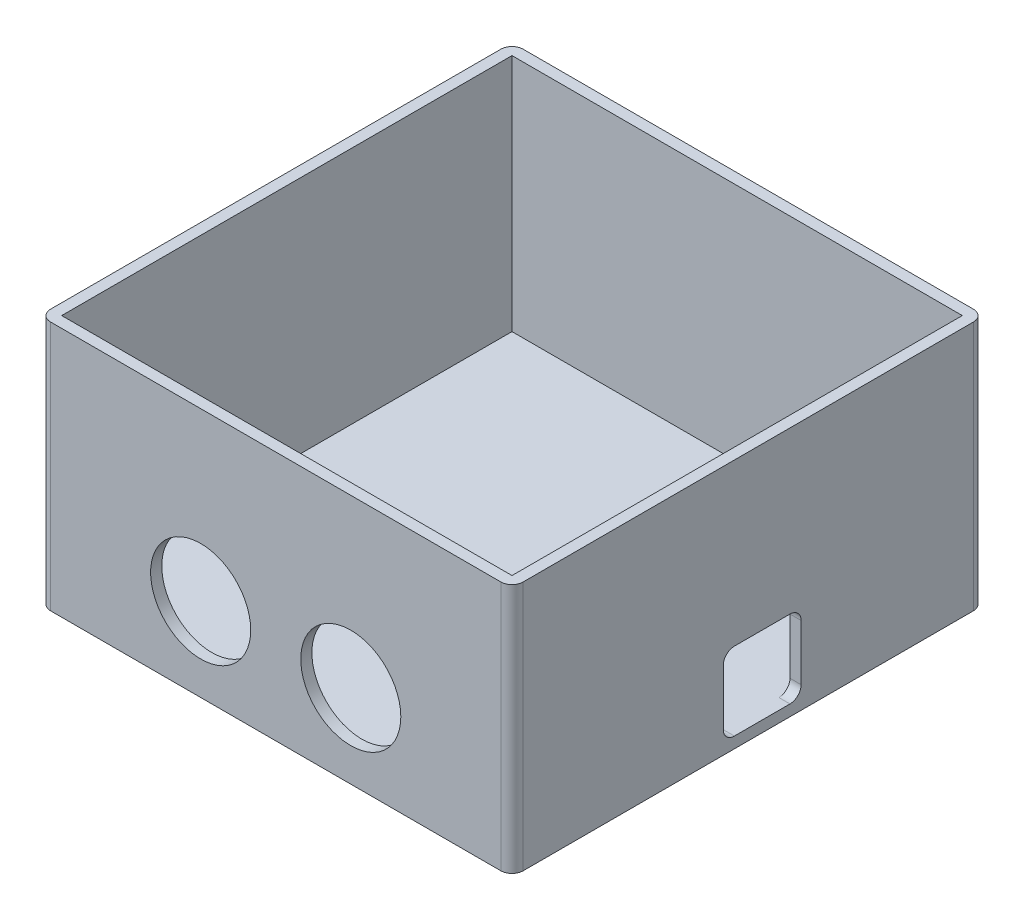
ISO-10303-21;
HEADER;
FILE_DESCRIPTION(('STEP AP214'),'2;1');
FILE_NAME('part.step','',(''),(''),'','','');
FILE_SCHEMA(('AUTOMOTIVE_DESIGN { 1 0 10303 214 1 1 1 1 }'));
ENDSEC;
DATA;
#1=APPLICATION_CONTEXT('core data for automotive mechanical design processes');
#2=APPLICATION_PROTOCOL_DEFINITION('international standard','automotive_design',2000,#1);
#3=PRODUCT_CONTEXT('',#1,'mechanical');
#4=PRODUCT('Part','Part','',(#3));
#5=PRODUCT_RELATED_PRODUCT_CATEGORY('part','',(#4));
#6=PRODUCT_DEFINITION_FORMATION('','',#4);
#7=PRODUCT_DEFINITION_CONTEXT('part definition',#1,'design');
#8=PRODUCT_DEFINITION('design','',#6,#7);
#9=PRODUCT_DEFINITION_SHAPE('','',#8);
#10=(LENGTH_UNIT() NAMED_UNIT(*) SI_UNIT(.MILLI.,.METRE.));
#11=(NAMED_UNIT(*) PLANE_ANGLE_UNIT() SI_UNIT($,.RADIAN.));
#12=(NAMED_UNIT(*) SI_UNIT($,.STERADIAN.) SOLID_ANGLE_UNIT());
#13=UNCERTAINTY_MEASURE_WITH_UNIT(LENGTH_MEASURE(1.E-05),#10,'distance_accuracy_value','');
#14=(GEOMETRIC_REPRESENTATION_CONTEXT(3) GLOBAL_UNCERTAINTY_ASSIGNED_CONTEXT((#13)) GLOBAL_UNIT_ASSIGNED_CONTEXT((#10,
#11,#12)) REPRESENTATION_CONTEXT('',''));
#15=CARTESIAN_POINT('',(0.,0.,0.));
#16=DIRECTION('',(0.,0.,1.));
#17=DIRECTION('',(1.,0.,0.));
#18=AXIS2_PLACEMENT_3D('',#15,#16,#17);
#19=CARTESIAN_POINT('',(-36.9623233908948,2.,-23.5243328100471));
#20=DIRECTION('',(0.,0.,-1.));
#21=DIRECTION('',(-1.,0.,0.));
#22=AXIS2_PLACEMENT_3D('',#19,#20,#21);
#23=PLANE('',#22);
#24=DIRECTION('',(-1.,0.,0.));
#25=VECTOR('',#24,1.);
#26=CARTESIAN_POINT('',(-36.9623233908948,45.,-23.5243328100471));
#27=LINE('',#26,#25);
#28=CARTESIAN_POINT('',(46.0376766091052,45.,-23.5243328100471));
#29=VERTEX_POINT('',#28);
#30=CARTESIAN_POINT('',(-34.9623233908948,45.,-23.5243328100471));
#31=VERTEX_POINT('',#30);
#32=EDGE_CURVE('E224',#29,#31,#27,.T.);
#33=ORIENTED_EDGE('',*,*,#32,.F.);
#34=DIRECTION('',(0.,-1.,0.));
#35=VECTOR('',#34,1.);
#36=CARTESIAN_POINT('',(46.0376766091052,2.,-23.5243328100471));
#37=LINE('',#36,#35);
#38=CARTESIAN_POINT('',(46.0376766091052,0.,-23.5243328100471));
#39=VERTEX_POINT('',#38);
#40=EDGE_CURVE('E261',#29,#39,#37,.T.);
#41=ORIENTED_EDGE('',*,*,#40,.T.);
#42=DIRECTION('',(1.,0.,0.));
#43=VECTOR('',#42,1.);
#44=CARTESIAN_POINT('',(-36.9623233908948,0.,-23.5243328100471));
#45=LINE('',#44,#43);
#46=CARTESIAN_POINT('',(-34.9623233908948,0.,-23.5243328100471));
#47=VERTEX_POINT('',#46);
#48=EDGE_CURVE('E227',#47,#39,#45,.T.);
#49=ORIENTED_EDGE('',*,*,#48,.F.);
#50=DIRECTION('',(0.,-1.,0.));
#51=VECTOR('',#50,1.);
#52=CARTESIAN_POINT('',(-34.9623233908948,45.,-23.5243328100471));
#53=LINE('',#52,#51);
#54=EDGE_CURVE('E259',#47,#31,#53,.F.);
#55=ORIENTED_EDGE('',*,*,#54,.T.);
#56=EDGE_LOOP('',(#33,#41,#49,#55));
#57=FACE_BOUND('',#56,.T.);
#58=ADVANCED_FACE('F33',(#57),#23,.T.);
#59=CARTESIAN_POINT('',(-36.9623233908948,2.,-23.5243328100471));
#60=DIRECTION('',(1.,0.,0.));
#61=DIRECTION('',(0.,0.,-1.));
#62=AXIS2_PLACEMENT_3D('',#59,#60,#61);
#63=PLANE('',#62);
#64=DIRECTION('',(0.,0.,1.));
#65=VECTOR('',#64,1.);
#66=CARTESIAN_POINT('',(-36.9623233908948,45.,-23.5243328100471));
#67=LINE('',#66,#65);
#68=CARTESIAN_POINT('',(-36.9623233908948,45.,-21.5243328100471));
#69=VERTEX_POINT('',#68);
#70=CARTESIAN_POINT('',(-36.9623233908948,45.,59.4756671899529));
#71=VERTEX_POINT('',#70);
#72=EDGE_CURVE('E191',#69,#71,#67,.T.);
#73=ORIENTED_EDGE('',*,*,#72,.F.);
#74=DIRECTION('',(0.,-1.,0.));
#75=VECTOR('',#74,1.);
#76=CARTESIAN_POINT('',(-36.9623233908948,0.,-21.5243328100471));
#77=LINE('',#76,#75);
#78=CARTESIAN_POINT('',(-36.9623233908948,0.,-21.5243328100471));
#79=VERTEX_POINT('',#78);
#80=EDGE_CURVE('E286',#69,#79,#77,.T.);
#81=ORIENTED_EDGE('',*,*,#80,.T.);
#82=DIRECTION('',(0.,0.,1.));
#83=VECTOR('',#82,1.);
#84=CARTESIAN_POINT('',(-36.9623233908948,0.,-23.5243328100471));
#85=LINE('',#84,#83);
#86=CARTESIAN_POINT('',(-36.9623233908948,0.,59.4756671899529));
#87=VERTEX_POINT('',#86);
#88=EDGE_CURVE('E235',#79,#87,#85,.T.);
#89=ORIENTED_EDGE('',*,*,#88,.T.);
#90=DIRECTION('',(0.,-1.,0.));
#91=VECTOR('',#90,1.);
#92=CARTESIAN_POINT('',(-36.9623233908948,2.,59.4756671899529));
#93=LINE('',#92,#91);
#94=EDGE_CURVE('E284',#87,#71,#93,.F.);
#95=ORIENTED_EDGE('',*,*,#94,.T.);
#96=EDGE_LOOP('',(#73,#81,#89,#95));
#97=FACE_BOUND('',#96,.T.);
#98=ADVANCED_FACE('F359',(#97),#63,.F.);
#99=CARTESIAN_POINT('',(-36.9623233908948,2.,61.4756671899529));
#100=DIRECTION('',(0.,0.,-1.));
#101=DIRECTION('',(-1.,0.,0.));
#102=AXIS2_PLACEMENT_3D('',#99,#100,#101);
#103=PLANE('',#102);
#104=CARTESIAN_POINT('',(-7.9623233908948,15.,61.4756671899529));
#105=DIRECTION('',(0.,0.,1.));
#106=DIRECTION('',(1.,0.,0.));
#107=AXIS2_PLACEMENT_3D('',#104,#105,#106);
#108=CIRCLE('',#107,9.);
#109=CARTESIAN_POINT('',(1.0376766091052,15.,61.4756671899529));
#110=VERTEX_POINT('',#109);
#111=EDGE_CURVE('E347',#110,#110,#108,.T.);
#112=ORIENTED_EDGE('',*,*,#111,.F.);
#113=EDGE_LOOP('',(#112));
#114=FACE_BOUND('',#113,.T.);
#115=CARTESIAN_POINT('',(19.0376766091052,15.,61.4756671899529));
#116=DIRECTION('',(0.,0.,1.));
#117=DIRECTION('',(1.,0.,0.));
#118=AXIS2_PLACEMENT_3D('',#115,#116,#117);
#119=CIRCLE('',#118,9.00000000000001);
#120=CARTESIAN_POINT('',(28.0376766091052,15.,61.4756671899529));
#121=VERTEX_POINT('',#120);
#122=EDGE_CURVE('E340',#121,#121,#119,.T.);
#123=ORIENTED_EDGE('',*,*,#122,.F.);
#124=EDGE_LOOP('',(#123));
#125=FACE_BOUND('',#124,.T.);
#126=DIRECTION('',(1.,0.,0.));
#127=VECTOR('',#126,1.);
#128=CARTESIAN_POINT('',(-36.9623233908948,45.,61.4756671899529));
#129=LINE('',#128,#127);
#130=CARTESIAN_POINT('',(-34.9623233908948,45.,61.4756671899529));
#131=VERTEX_POINT('',#130);
#132=CARTESIAN_POINT('',(46.0376766091052,45.,61.4756671899529));
#133=VERTEX_POINT('',#132);
#134=EDGE_CURVE('E219',#131,#133,#129,.T.);
#135=ORIENTED_EDGE('',*,*,#134,.F.);
#136=DIRECTION('',(0.,-1.,0.));
#137=VECTOR('',#136,1.);
#138=CARTESIAN_POINT('',(-34.9623233908948,2.,61.4756671899529));
#139=LINE('',#138,#137);
#140=CARTESIAN_POINT('',(-34.9623233908948,0.,61.4756671899529));
#141=VERTEX_POINT('',#140);
#142=EDGE_CURVE('E290',#131,#141,#139,.T.);
#143=ORIENTED_EDGE('',*,*,#142,.T.);
#144=DIRECTION('',(1.,0.,0.));
#145=VECTOR('',#144,1.);
#146=CARTESIAN_POINT('',(-36.9623233908948,0.,61.4756671899529));
#147=LINE('',#146,#145);
#148=CARTESIAN_POINT('',(46.0376766091052,0.,61.4756671899529));
#149=VERTEX_POINT('',#148);
#150=EDGE_CURVE('E233',#141,#149,#147,.T.);
#151=ORIENTED_EDGE('',*,*,#150,.T.);
#152=DIRECTION('',(0.,-1.,0.));
#153=VECTOR('',#152,1.);
#154=CARTESIAN_POINT('',(46.0376766091052,45.,61.4756671899529));
#155=LINE('',#154,#153);
#156=EDGE_CURVE('E48',#149,#133,#155,.F.);
#157=ORIENTED_EDGE('',*,*,#156,.T.);
#158=EDGE_LOOP('',(#135,#143,#151,#157));
#159=FACE_BOUND('',#158,.T.);
#160=ADVANCED_FACE('F357',(#114,#125,#159),#103,.F.);
#161=CARTESIAN_POINT('',(48.0376766091052,2.,-23.5243328100471));
#162=DIRECTION('',(1.,0.,0.));
#163=DIRECTION('',(0.,0.,-1.));
#164=AXIS2_PLACEMENT_3D('',#161,#162,#163);
#165=PLANE('',#164);
#166=DIRECTION('',(0.,-1.,0.));
#167=VECTOR('',#166,1.);
#168=CARTESIAN_POINT('',(48.0376766091052,16.,23.4756671899529));
#169=LINE('',#168,#167);
#170=CARTESIAN_POINT('',(48.0376766091052,14.,23.4756671899529));
#171=VERTEX_POINT('',#170);
#172=CARTESIAN_POINT('',(48.0376766091052,4.,23.4756671899529));
#173=VERTEX_POINT('',#172);
#174=EDGE_CURVE('E310',#171,#173,#169,.T.);
#175=ORIENTED_EDGE('',*,*,#174,.F.);
#176=CARTESIAN_POINT('',(48.0376766091052,14.,21.4756671899529));
#177=DIRECTION('',(1.,0.,0.));
#178=DIRECTION('',(0.,0.,-1.));
#179=AXIS2_PLACEMENT_3D('',#176,#177,#178);
#180=CIRCLE('',#179,2.);
#181=CARTESIAN_POINT('',(48.0376766091052,16.,21.4756671899529));
#182=VERTEX_POINT('',#181);
#183=EDGE_CURVE('E301',#171,#182,#180,.F.);
#184=ORIENTED_EDGE('',*,*,#183,.T.);
#185=DIRECTION('',(0.,0.,1.));
#186=VECTOR('',#185,1.);
#187=CARTESIAN_POINT('',(48.0376766091052,16.,23.4756671899529));
#188=LINE('',#187,#186);
#189=CARTESIAN_POINT('',(48.0376766091052,16.,11.4756671899529));
#190=VERTEX_POINT('',#189);
#191=EDGE_CURVE('E331',#190,#182,#188,.T.);
#192=ORIENTED_EDGE('',*,*,#191,.F.);
#193=CARTESIAN_POINT('',(48.0376766091052,14.,11.4756671899529));
#194=DIRECTION('',(1.,0.,0.));
#195=DIRECTION('',(0.,0.,-1.));
#196=AXIS2_PLACEMENT_3D('',#193,#194,#195);
#197=CIRCLE('',#196,2.);
#198=CARTESIAN_POINT('',(48.0376766091052,14.,9.47566718995292));
#199=VERTEX_POINT('',#198);
#200=EDGE_CURVE('E297',#190,#199,#197,.F.);
#201=ORIENTED_EDGE('',*,*,#200,.T.);
#202=DIRECTION('',(0.,1.,0.));
#203=VECTOR('',#202,1.);
#204=CARTESIAN_POINT('',(48.0376766091052,16.,9.47566718995292));
#205=LINE('',#204,#203);
#206=CARTESIAN_POINT('',(48.0376766091052,4.,9.47566718995291));
#207=VERTEX_POINT('',#206);
#208=EDGE_CURVE('E337',#207,#199,#205,.T.);
#209=ORIENTED_EDGE('',*,*,#208,.F.);
#210=CARTESIAN_POINT('',(48.0376766091052,4.,11.4756671899529));
#211=DIRECTION('',(1.,0.,0.));
#212=DIRECTION('',(0.,0.,-1.));
#213=AXIS2_PLACEMENT_3D('',#210,#211,#212);
#214=CIRCLE('',#213,2.);
#215=CARTESIAN_POINT('',(48.0376766091052,2.,11.4756671899529));
#216=VERTEX_POINT('',#215);
#217=EDGE_CURVE('E293',#207,#216,#214,.F.);
#218=ORIENTED_EDGE('',*,*,#217,.T.);
#219=DIRECTION('',(0.,0.,-1.));
#220=VECTOR('',#219,1.);
#221=CARTESIAN_POINT('',(48.0376766091052,2.,23.4756671899529));
#222=LINE('',#221,#220);
#223=CARTESIAN_POINT('',(48.0376766091052,2.,21.4756671899529));
#224=VERTEX_POINT('',#223);
#225=EDGE_CURVE('E312',#224,#216,#222,.T.);
#226=ORIENTED_EDGE('',*,*,#225,.F.);
#227=CARTESIAN_POINT('',(48.0376766091052,4.,21.4756671899529));
#228=DIRECTION('',(1.,0.,0.));
#229=DIRECTION('',(0.,0.,-1.));
#230=AXIS2_PLACEMENT_3D('',#227,#228,#229);
#231=CIRCLE('',#230,2.);
#232=EDGE_CURVE('E41',#224,#173,#231,.F.);
#233=ORIENTED_EDGE('',*,*,#232,.T.);
#234=EDGE_LOOP('',(#175,#184,#192,#201,#209,#218,#226,#233));
#235=FACE_BOUND('',#234,.T.);
#236=DIRECTION('',(0.,0.,1.));
#237=VECTOR('',#236,1.);
#238=CARTESIAN_POINT('',(48.0376766091052,0.,-23.5243328100471));
#239=LINE('',#238,#237);
#240=CARTESIAN_POINT('',(48.0376766091052,0.,-21.5243328100471));
#241=VERTEX_POINT('',#240);
#242=CARTESIAN_POINT('',(48.0376766091052,0.,59.4756671899529));
#243=VERTEX_POINT('',#242);
#244=EDGE_CURVE('E230',#241,#243,#239,.T.);
#245=ORIENTED_EDGE('',*,*,#244,.F.);
#246=DIRECTION('',(0.,-1.,0.));
#247=VECTOR('',#246,1.);
#248=CARTESIAN_POINT('',(48.0376766091052,2.,-21.5243328100471));
#249=LINE('',#248,#247);
#250=CARTESIAN_POINT('',(48.0376766091052,45.,-21.5243328100471));
#251=VERTEX_POINT('',#250);
#252=EDGE_CURVE('E275',#241,#251,#249,.F.);
#253=ORIENTED_EDGE('',*,*,#252,.T.);
#254=DIRECTION('',(0.,0.,-1.));
#255=VECTOR('',#254,1.);
#256=CARTESIAN_POINT('',(48.0376766091052,45.,-23.5243328100471));
#257=LINE('',#256,#255);
#258=CARTESIAN_POINT('',(48.0376766091052,45.,59.4756671899529));
#259=VERTEX_POINT('',#258);
#260=EDGE_CURVE('E221',#259,#251,#257,.T.);
#261=ORIENTED_EDGE('',*,*,#260,.F.);
#262=DIRECTION('',(0.,-1.,0.));
#263=VECTOR('',#262,1.);
#264=CARTESIAN_POINT('',(48.0376766091052,0.,59.4756671899529));
#265=LINE('',#264,#263);
#266=EDGE_CURVE('E272',#259,#243,#265,.T.);
#267=ORIENTED_EDGE('',*,*,#266,.T.);
#268=EDGE_LOOP('',(#245,#253,#261,#267));
#269=FACE_BOUND('',#268,.T.);
#270=ADVANCED_FACE('F308',(#235,#269),#165,.T.);
#271=CARTESIAN_POINT('',(0.,0.,0.));
#272=DIRECTION('',(0.,-1.,0.));
#273=DIRECTION('',(0.,0.,-1.));
#274=AXIS2_PLACEMENT_3D('',#271,#272,#273);
#275=PLANE('',#274);
#276=ORIENTED_EDGE('',*,*,#48,.T.);
#277=CARTESIAN_POINT('',(46.0376766091052,0.,-21.5243328100471));
#278=DIRECTION('',(0.,-1.,0.));
#279=DIRECTION('',(0.,0.,-1.));
#280=AXIS2_PLACEMENT_3D('',#277,#278,#279);
#281=CIRCLE('',#280,2.);
#282=EDGE_CURVE('E270',#39,#241,#281,.T.);
#283=ORIENTED_EDGE('',*,*,#282,.T.);
#284=ORIENTED_EDGE('',*,*,#244,.T.);
#285=CARTESIAN_POINT('',(46.0376766091052,0.,59.4756671899529));
#286=DIRECTION('',(0.,-1.,0.));
#287=DIRECTION('',(0.,0.,-1.));
#288=AXIS2_PLACEMENT_3D('',#285,#286,#287);
#289=CIRCLE('',#288,2.);
#290=EDGE_CURVE('E264',#243,#149,#289,.T.);
#291=ORIENTED_EDGE('',*,*,#290,.T.);
#292=ORIENTED_EDGE('',*,*,#150,.F.);
#293=CARTESIAN_POINT('',(-34.9623233908948,0.,59.4756671899529));
#294=DIRECTION('',(0.,-1.,0.));
#295=DIRECTION('',(0.,0.,-1.));
#296=AXIS2_PLACEMENT_3D('',#293,#294,#295);
#297=CIRCLE('',#296,2.);
#298=EDGE_CURVE('E266',#141,#87,#297,.T.);
#299=ORIENTED_EDGE('',*,*,#298,.T.);
#300=ORIENTED_EDGE('',*,*,#88,.F.);
#301=CARTESIAN_POINT('',(-34.9623233908948,0.,-21.5243328100471));
#302=DIRECTION('',(0.,-1.,0.));
#303=DIRECTION('',(0.,0.,-1.));
#304=AXIS2_PLACEMENT_3D('',#301,#302,#303);
#305=CIRCLE('',#304,2.);
#306=EDGE_CURVE('E268',#79,#47,#305,.T.);
#307=ORIENTED_EDGE('',*,*,#306,.T.);
#308=EDGE_LOOP('',(#276,#283,#284,#291,#292,#299,#300,#307));
#309=FACE_BOUND('',#308,.T.);
#310=ADVANCED_FACE('F370',(#309),#275,.T.);
#311=CARTESIAN_POINT('',(0.,45.,0.));
#312=DIRECTION('',(0.,1.,0.));
#313=DIRECTION('',(0.,0.,1.));
#314=AXIS2_PLACEMENT_3D('',#311,#312,#313);
#315=PLANE('',#314);
#316=ORIENTED_EDGE('',*,*,#260,.T.);
#317=CARTESIAN_POINT('',(46.0376766091052,45.,-21.5243328100471));
#318=DIRECTION('',(0.,1.,0.));
#319=DIRECTION('',(0.,0.,1.));
#320=AXIS2_PLACEMENT_3D('',#317,#318,#319);
#321=CIRCLE('',#320,2.);
#322=EDGE_CURVE('E282',#251,#29,#321,.T.);
#323=ORIENTED_EDGE('',*,*,#322,.T.);
#324=ORIENTED_EDGE('',*,*,#32,.T.);
#325=CARTESIAN_POINT('',(-34.9623233908948,45.,-21.5243328100471));
#326=DIRECTION('',(0.,1.,0.));
#327=DIRECTION('',(0.,0.,1.));
#328=AXIS2_PLACEMENT_3D('',#325,#326,#327);
#329=CIRCLE('',#328,2.);
#330=EDGE_CURVE('E280',#31,#69,#329,.T.);
#331=ORIENTED_EDGE('',*,*,#330,.T.);
#332=ORIENTED_EDGE('',*,*,#72,.T.);
#333=CARTESIAN_POINT('',(-34.9623233908948,45.,59.4756671899529));
#334=DIRECTION('',(0.,1.,0.));
#335=DIRECTION('',(0.,0.,1.));
#336=AXIS2_PLACEMENT_3D('',#333,#334,#335);
#337=CIRCLE('',#336,2.);
#338=EDGE_CURVE('E55',#71,#131,#337,.T.);
#339=ORIENTED_EDGE('',*,*,#338,.T.);
#340=ORIENTED_EDGE('',*,*,#134,.T.);
#341=CARTESIAN_POINT('',(46.0376766091052,45.,59.4756671899529));
#342=DIRECTION('',(0.,1.,0.));
#343=DIRECTION('',(0.,0.,1.));
#344=AXIS2_PLACEMENT_3D('',#341,#342,#343);
#345=CIRCLE('',#344,2.);
#346=EDGE_CURVE('E277',#133,#259,#345,.T.);
#347=ORIENTED_EDGE('',*,*,#346,.T.);
#348=EDGE_LOOP('',(#316,#323,#324,#331,#332,#339,#340,#347));
#349=FACE_BOUND('',#348,.T.);
#350=DIRECTION('',(1.,0.,0.));
#351=VECTOR('',#350,1.);
#352=CARTESIAN_POINT('',(-34.9623233908948,45.,59.4756671899529));
#353=LINE('',#352,#351);
#354=CARTESIAN_POINT('',(-34.9623233908948,45.,59.4756671899529));
#355=VERTEX_POINT('',#354);
#356=CARTESIAN_POINT('',(46.0376766091052,45.,59.4756671899529));
#357=VERTEX_POINT('',#356);
#358=EDGE_CURVE('E183',#355,#357,#353,.T.);
#359=ORIENTED_EDGE('',*,*,#358,.F.);
#360=DIRECTION('',(0.,0.,1.));
#361=VECTOR('',#360,1.);
#362=CARTESIAN_POINT('',(-34.9623233908948,45.,-21.5243328100471));
#363=LINE('',#362,#361);
#364=CARTESIAN_POINT('',(-34.9623233908948,45.,-21.5243328100471));
#365=VERTEX_POINT('',#364);
#366=EDGE_CURVE('E173',#365,#355,#363,.T.);
#367=ORIENTED_EDGE('',*,*,#366,.F.);
#368=DIRECTION('',(-1.,0.,0.));
#369=VECTOR('',#368,1.);
#370=CARTESIAN_POINT('',(-34.9623233908948,45.,-21.5243328100471));
#371=LINE('',#370,#369);
#372=CARTESIAN_POINT('',(46.0376766091052,45.,-21.5243328100471));
#373=VERTEX_POINT('',#372);
#374=EDGE_CURVE('E199',#373,#365,#371,.T.);
#375=ORIENTED_EDGE('',*,*,#374,.F.);
#376=DIRECTION('',(0.,0.,-1.));
#377=VECTOR('',#376,1.);
#378=CARTESIAN_POINT('',(46.0376766091052,45.,-21.5243328100471));
#379=LINE('',#378,#377);
#380=EDGE_CURVE('E197',#357,#373,#379,.T.);
#381=ORIENTED_EDGE('',*,*,#380,.F.);
#382=EDGE_LOOP('',(#359,#367,#375,#381));
#383=FACE_BOUND('',#382,.T.);
#384=ADVANCED_FACE('F195',(#349,#383),#315,.T.);
#385=CARTESIAN_POINT('',(-34.9623233908948,45.,-21.5243328100471));
#386=DIRECTION('',(1.,0.,0.));
#387=DIRECTION('',(0.,0.,-1.));
#388=AXIS2_PLACEMENT_3D('',#385,#386,#387);
#389=PLANE('',#388);
#390=DIRECTION('',(0.,0.,1.));
#391=VECTOR('',#390,1.);
#392=CARTESIAN_POINT('',(-34.9623233908948,2.,-21.5243328100471));
#393=LINE('',#392,#391);
#394=CARTESIAN_POINT('',(-34.9623233908948,2.,-21.5243328100471));
#395=VERTEX_POINT('',#394);
#396=CARTESIAN_POINT('',(-34.9623233908948,2.,59.4756671899529));
#397=VERTEX_POINT('',#396);
#398=EDGE_CURVE('E204',#395,#397,#393,.T.);
#399=ORIENTED_EDGE('',*,*,#398,.F.);
#400=DIRECTION('',(0.,-1.,0.));
#401=VECTOR('',#400,1.);
#402=CARTESIAN_POINT('',(-34.9623233908948,45.,-21.5243328100471));
#403=LINE('',#402,#401);
#404=EDGE_CURVE('E179',#365,#395,#403,.T.);
#405=ORIENTED_EDGE('',*,*,#404,.F.);
#406=ORIENTED_EDGE('',*,*,#366,.T.);
#407=DIRECTION('',(0.,-1.,0.));
#408=VECTOR('',#407,1.);
#409=CARTESIAN_POINT('',(-34.9623233908948,45.,59.4756671899529));
#410=LINE('',#409,#408);
#411=EDGE_CURVE('E177',#355,#397,#410,.T.);
#412=ORIENTED_EDGE('',*,*,#411,.T.);
#413=EDGE_LOOP('',(#399,#405,#406,#412));
#414=FACE_BOUND('',#413,.T.);
#415=ADVANCED_FACE('F176',(#414),#389,.T.);
#416=CARTESIAN_POINT('',(-34.9623233908948,45.,59.4756671899529));
#417=DIRECTION('',(0.,0.,-1.));
#418=DIRECTION('',(-1.,0.,0.));
#419=AXIS2_PLACEMENT_3D('',#416,#417,#418);
#420=PLANE('',#419);
#421=CARTESIAN_POINT('',(-7.9623233908948,15.,59.4756671899529));
#422=DIRECTION('',(0.,0.,1.));
#423=DIRECTION('',(1.,0.,0.));
#424=AXIS2_PLACEMENT_3D('',#421,#422,#423);
#425=CIRCLE('',#424,9.);
#426=CARTESIAN_POINT('',(1.0376766091052,15.,59.4756671899529));
#427=VERTEX_POINT('',#426);
#428=EDGE_CURVE('E206',#427,#427,#425,.T.);
#429=ORIENTED_EDGE('',*,*,#428,.T.);
#430=EDGE_LOOP('',(#429));
#431=FACE_BOUND('',#430,.T.);
#432=CARTESIAN_POINT('',(19.0376766091052,15.,59.4756671899529));
#433=DIRECTION('',(0.,0.,1.));
#434=DIRECTION('',(1.,0.,0.));
#435=AXIS2_PLACEMENT_3D('',#432,#433,#434);
#436=CIRCLE('',#435,9.00000000000001);
#437=CARTESIAN_POINT('',(28.0376766091052,15.,59.4756671899529));
#438=VERTEX_POINT('',#437);
#439=EDGE_CURVE('E350',#438,#438,#436,.T.);
#440=ORIENTED_EDGE('',*,*,#439,.T.);
#441=EDGE_LOOP('',(#440));
#442=FACE_BOUND('',#441,.T.);
#443=DIRECTION('',(1.,0.,0.));
#444=VECTOR('',#443,1.);
#445=CARTESIAN_POINT('',(-34.9623233908948,2.,59.4756671899529));
#446=LINE('',#445,#444);
#447=CARTESIAN_POINT('',(46.0376766091052,2.,59.4756671899529));
#448=VERTEX_POINT('',#447);
#449=EDGE_CURVE('E190',#397,#448,#446,.T.);
#450=ORIENTED_EDGE('',*,*,#449,.F.);
#451=ORIENTED_EDGE('',*,*,#411,.F.);
#452=ORIENTED_EDGE('',*,*,#358,.T.);
#453=DIRECTION('',(0.,-1.,0.));
#454=VECTOR('',#453,1.);
#455=CARTESIAN_POINT('',(46.0376766091052,45.,59.4756671899529));
#456=LINE('',#455,#454);
#457=EDGE_CURVE('E192',#357,#448,#456,.T.);
#458=ORIENTED_EDGE('',*,*,#457,.T.);
#459=EDGE_LOOP('',(#450,#451,#452,#458));
#460=FACE_BOUND('',#459,.T.);
#461=ADVANCED_FACE('F187',(#431,#442,#460),#420,.T.);
#462=CARTESIAN_POINT('',(46.0376766091052,45.,-21.5243328100471));
#463=DIRECTION('',(-1.,0.,0.));
#464=DIRECTION('',(0.,0.,1.));
#465=AXIS2_PLACEMENT_3D('',#462,#463,#464);
#466=PLANE('',#465);
#467=DIRECTION('',(0.,0.,1.));
#468=VECTOR('',#467,1.);
#469=CARTESIAN_POINT('',(46.0376766091052,16.,23.4756671899529));
#470=LINE('',#469,#468);
#471=CARTESIAN_POINT('',(46.0376766091052,16.,11.4756671899529));
#472=VERTEX_POINT('',#471);
#473=CARTESIAN_POINT('',(46.0376766091052,16.,21.4756671899529));
#474=VERTEX_POINT('',#473);
#475=EDGE_CURVE('E334',#472,#474,#470,.T.);
#476=ORIENTED_EDGE('',*,*,#475,.T.);
#477=CARTESIAN_POINT('',(46.0376766091052,14.,21.4756671899529));
#478=DIRECTION('',(-1.,0.,0.));
#479=DIRECTION('',(0.,0.,1.));
#480=AXIS2_PLACEMENT_3D('',#477,#478,#479);
#481=CIRCLE('',#480,2.);
#482=CARTESIAN_POINT('',(46.0376766091052,14.,23.4756671899529));
#483=VERTEX_POINT('',#482);
#484=EDGE_CURVE('E303',#474,#483,#481,.F.);
#485=ORIENTED_EDGE('',*,*,#484,.T.);
#486=DIRECTION('',(0.,-1.,0.));
#487=VECTOR('',#486,1.);
#488=CARTESIAN_POINT('',(46.0376766091052,16.,23.4756671899529));
#489=LINE('',#488,#487);
#490=CARTESIAN_POINT('',(46.0376766091052,4.,23.4756671899529));
#491=VERTEX_POINT('',#490);
#492=EDGE_CURVE('E328',#483,#491,#489,.T.);
#493=ORIENTED_EDGE('',*,*,#492,.T.);
#494=CARTESIAN_POINT('',(46.0376766091052,4.,21.4756671899529));
#495=DIRECTION('',(-1.,0.,0.));
#496=DIRECTION('',(0.,0.,1.));
#497=AXIS2_PLACEMENT_3D('',#494,#495,#496);
#498=CIRCLE('',#497,2.);
#499=CARTESIAN_POINT('',(46.0376766091052,2.,21.4756671899529));
#500=VERTEX_POINT('',#499);
#501=EDGE_CURVE('E11',#491,#500,#498,.F.);
#502=ORIENTED_EDGE('',*,*,#501,.T.);
#503=DIRECTION('',(0.,0.,-1.));
#504=VECTOR('',#503,1.);
#505=CARTESIAN_POINT('',(46.0376766091052,2.,-21.5243328100471));
#506=LINE('',#505,#504);
#507=EDGE_CURVE('E209',#448,#500,#506,.T.);
#508=ORIENTED_EDGE('',*,*,#507,.F.);
#509=ORIENTED_EDGE('',*,*,#457,.F.);
#510=ORIENTED_EDGE('',*,*,#380,.T.);
#511=DIRECTION('',(0.,-1.,0.));
#512=VECTOR('',#511,1.);
#513=CARTESIAN_POINT('',(46.0376766091052,45.,-21.5243328100471));
#514=LINE('',#513,#512);
#515=CARTESIAN_POINT('',(46.0376766091052,2.,-21.5243328100471));
#516=VERTEX_POINT('',#515);
#517=EDGE_CURVE('E214',#373,#516,#514,.T.);
#518=ORIENTED_EDGE('',*,*,#517,.T.);
#519=CARTESIAN_POINT('',(46.0376766091052,2.,11.4756671899529));
#520=VERTEX_POINT('',#519);
#521=EDGE_CURVE('E208',#520,#516,#506,.T.);
#522=ORIENTED_EDGE('',*,*,#521,.F.);
#523=CARTESIAN_POINT('',(46.0376766091052,4.,11.4756671899529));
#524=DIRECTION('',(-1.,0.,0.));
#525=DIRECTION('',(0.,0.,1.));
#526=AXIS2_PLACEMENT_3D('',#523,#524,#525);
#527=CIRCLE('',#526,2.);
#528=CARTESIAN_POINT('',(46.0376766091052,4.,9.47566718995291));
#529=VERTEX_POINT('',#528);
#530=EDGE_CURVE('E295',#520,#529,#527,.F.);
#531=ORIENTED_EDGE('',*,*,#530,.T.);
#532=DIRECTION('',(0.,1.,0.));
#533=VECTOR('',#532,1.);
#534=CARTESIAN_POINT('',(46.0376766091052,16.,9.47566718995292));
#535=LINE('',#534,#533);
#536=CARTESIAN_POINT('',(46.0376766091052,14.,9.47566718995292));
#537=VERTEX_POINT('',#536);
#538=EDGE_CURVE('E330',#529,#537,#535,.T.);
#539=ORIENTED_EDGE('',*,*,#538,.T.);
#540=CARTESIAN_POINT('',(46.0376766091052,14.,11.4756671899529));
#541=DIRECTION('',(-1.,0.,0.));
#542=DIRECTION('',(0.,0.,1.));
#543=AXIS2_PLACEMENT_3D('',#540,#541,#542);
#544=CIRCLE('',#543,2.);
#545=EDGE_CURVE('E299',#537,#472,#544,.F.);
#546=ORIENTED_EDGE('',*,*,#545,.T.);
#547=EDGE_LOOP('',(#476,#485,#493,#502,#508,#509,#510,#518,#522,#531,#539,#546));
#548=FACE_BOUND('',#547,.T.);
#549=ADVANCED_FACE('F327',(#548),#466,.T.);
#550=CARTESIAN_POINT('',(-34.9623233908948,45.,-21.5243328100471));
#551=DIRECTION('',(0.,0.,1.));
#552=DIRECTION('',(1.,0.,0.));
#553=AXIS2_PLACEMENT_3D('',#550,#551,#552);
#554=PLANE('',#553);
#555=DIRECTION('',(-1.,0.,0.));
#556=VECTOR('',#555,1.);
#557=CARTESIAN_POINT('',(-34.9623233908948,2.,-21.5243328100471));
#558=LINE('',#557,#556);
#559=EDGE_CURVE('E184',#516,#395,#558,.T.);
#560=ORIENTED_EDGE('',*,*,#559,.F.);
#561=ORIENTED_EDGE('',*,*,#517,.F.);
#562=ORIENTED_EDGE('',*,*,#374,.T.);
#563=ORIENTED_EDGE('',*,*,#404,.T.);
#564=EDGE_LOOP('',(#560,#561,#562,#563));
#565=FACE_BOUND('',#564,.T.);
#566=ADVANCED_FACE('F510',(#565),#554,.T.);
#567=CARTESIAN_POINT('',(0.,2.,0.));
#568=DIRECTION('',(0.,-1.,0.));
#569=DIRECTION('',(0.,0.,-1.));
#570=AXIS2_PLACEMENT_3D('',#567,#568,#569);
#571=PLANE('',#570);
#572=ORIENTED_EDGE('',*,*,#225,.T.);
#573=DIRECTION('',(1.,0.,0.));
#574=VECTOR('',#573,1.);
#575=CARTESIAN_POINT('',(46.0376766091052,2.,11.4756671899529));
#576=LINE('',#575,#574);
#577=EDGE_CURVE('E246',#216,#520,#576,.F.);
#578=ORIENTED_EDGE('',*,*,#577,.T.);
#579=ORIENTED_EDGE('',*,*,#521,.T.);
#580=ORIENTED_EDGE('',*,*,#559,.T.);
#581=ORIENTED_EDGE('',*,*,#398,.T.);
#582=ORIENTED_EDGE('',*,*,#449,.T.);
#583=ORIENTED_EDGE('',*,*,#507,.T.);
#584=DIRECTION('',(1.,0.,0.));
#585=VECTOR('',#584,1.);
#586=CARTESIAN_POINT('',(48.0376766091052,2.,21.4756671899529));
#587=LINE('',#586,#585);
#588=EDGE_CURVE('E243',#500,#224,#587,.T.);
#589=ORIENTED_EDGE('',*,*,#588,.T.);
#590=EDGE_LOOP('',(#572,#578,#579,#580,#581,#582,#583,#589));
#591=FACE_BOUND('',#590,.T.);
#592=ADVANCED_FACE('F506',(#591),#571,.F.);
#593=CARTESIAN_POINT('',(19.0376766091052,15.,59.4756671899529));
#594=DIRECTION('',(0.,0.,1.));
#595=DIRECTION('',(1.,0.,0.));
#596=AXIS2_PLACEMENT_3D('',#593,#594,#595);
#597=CYLINDRICAL_SURFACE('',#596,9.00000000000001);
#598=ORIENTED_EDGE('',*,*,#439,.F.);
#599=EDGE_LOOP('',(#598));
#600=FACE_BOUND('',#599,.T.);
#601=ORIENTED_EDGE('',*,*,#122,.T.);
#602=EDGE_LOOP('',(#601));
#603=FACE_BOUND('',#602,.T.);
#604=ADVANCED_FACE('F355',(#600,#603),#597,.F.);
#605=CARTESIAN_POINT('',(-7.9623233908948,15.,59.4756671899529));
#606=DIRECTION('',(0.,0.,1.));
#607=DIRECTION('',(1.,0.,0.));
#608=AXIS2_PLACEMENT_3D('',#605,#606,#607);
#609=CYLINDRICAL_SURFACE('',#608,9.);
#610=ORIENTED_EDGE('',*,*,#428,.F.);
#611=EDGE_LOOP('',(#610));
#612=FACE_BOUND('',#611,.T.);
#613=ORIENTED_EDGE('',*,*,#111,.T.);
#614=EDGE_LOOP('',(#613));
#615=FACE_BOUND('',#614,.T.);
#616=ADVANCED_FACE('F499',(#612,#615),#609,.F.);
#617=CARTESIAN_POINT('',(46.0376766091052,16.,23.4756671899529));
#618=DIRECTION('',(0.,0.,1.));
#619=DIRECTION('',(0.,-1.,0.));
#620=AXIS2_PLACEMENT_3D('',#617,#618,#619);
#621=PLANE('',#620);
#622=ORIENTED_EDGE('',*,*,#492,.F.);
#623=DIRECTION('',(1.,0.,0.));
#624=VECTOR('',#623,1.);
#625=CARTESIAN_POINT('',(48.0376766091052,14.,23.4756671899529));
#626=LINE('',#625,#624);
#627=EDGE_CURVE('E256',#483,#171,#626,.T.);
#628=ORIENTED_EDGE('',*,*,#627,.T.);
#629=ORIENTED_EDGE('',*,*,#174,.T.);
#630=DIRECTION('',(1.,0.,0.));
#631=VECTOR('',#630,1.);
#632=CARTESIAN_POINT('',(46.0376766091052,4.,23.4756671899529));
#633=LINE('',#632,#631);
#634=EDGE_CURVE('E254',#173,#491,#633,.F.);
#635=ORIENTED_EDGE('',*,*,#634,.T.);
#636=EDGE_LOOP('',(#622,#628,#629,#635));
#637=FACE_BOUND('',#636,.T.);
#638=ADVANCED_FACE('F318',(#637),#621,.F.);
#639=CARTESIAN_POINT('',(46.0376766091052,16.,23.4756671899529));
#640=DIRECTION('',(0.,1.,0.));
#641=DIRECTION('',(0.,0.,1.));
#642=AXIS2_PLACEMENT_3D('',#639,#640,#641);
#643=PLANE('',#642);
#644=ORIENTED_EDGE('',*,*,#475,.F.);
#645=DIRECTION('',(1.,0.,0.));
#646=VECTOR('',#645,1.);
#647=CARTESIAN_POINT('',(48.0376766091052,16.,11.4756671899529));
#648=LINE('',#647,#646);
#649=EDGE_CURVE('E251',#472,#190,#648,.T.);
#650=ORIENTED_EDGE('',*,*,#649,.T.);
#651=ORIENTED_EDGE('',*,*,#191,.T.);
#652=DIRECTION('',(1.,0.,0.));
#653=VECTOR('',#652,1.);
#654=CARTESIAN_POINT('',(46.0376766091052,16.,21.4756671899529));
#655=LINE('',#654,#653);
#656=EDGE_CURVE('E249',#182,#474,#655,.F.);
#657=ORIENTED_EDGE('',*,*,#656,.T.);
#658=EDGE_LOOP('',(#644,#650,#651,#657));
#659=FACE_BOUND('',#658,.T.);
#660=ADVANCED_FACE('F480',(#659),#643,.F.);
#661=CARTESIAN_POINT('',(46.0376766091052,16.,9.47566718995292));
#662=DIRECTION('',(0.,0.,-1.));
#663=DIRECTION('',(0.,1.,0.));
#664=AXIS2_PLACEMENT_3D('',#661,#662,#663);
#665=PLANE('',#664);
#666=ORIENTED_EDGE('',*,*,#538,.F.);
#667=DIRECTION('',(1.,0.,0.));
#668=VECTOR('',#667,1.);
#669=CARTESIAN_POINT('',(48.0376766091052,4.,9.47566718995291));
#670=LINE('',#669,#668);
#671=EDGE_CURVE('E240',#529,#207,#670,.T.);
#672=ORIENTED_EDGE('',*,*,#671,.T.);
#673=ORIENTED_EDGE('',*,*,#208,.T.);
#674=DIRECTION('',(1.,0.,0.));
#675=VECTOR('',#674,1.);
#676=CARTESIAN_POINT('',(46.0376766091052,14.,9.47566718995292));
#677=LINE('',#676,#675);
#678=EDGE_CURVE('E238',#199,#537,#677,.F.);
#679=ORIENTED_EDGE('',*,*,#678,.T.);
#680=EDGE_LOOP('',(#666,#672,#673,#679));
#681=FACE_BOUND('',#680,.T.);
#682=ADVANCED_FACE('F411',(#681),#665,.F.);
#683=CARTESIAN_POINT('',(46.0376766091052,4.,11.4756671899529));
#684=DIRECTION('',(-1.,0.,0.));
#685=DIRECTION('',(0.,0.,1.));
#686=AXIS2_PLACEMENT_3D('',#683,#684,#685);
#687=CYLINDRICAL_SURFACE('',#686,2.);
#688=ORIENTED_EDGE('',*,*,#530,.F.);
#689=ORIENTED_EDGE('',*,*,#577,.F.);
#690=ORIENTED_EDGE('',*,*,#217,.F.);
#691=ORIENTED_EDGE('',*,*,#671,.F.);
#692=EDGE_LOOP('',(#688,#689,#690,#691));
#693=FACE_BOUND('',#692,.T.);
#694=ADVANCED_FACE('F407',(#693),#687,.F.);
#695=CARTESIAN_POINT('',(46.0376766091052,14.,11.4756671899529));
#696=DIRECTION('',(-1.,0.,0.));
#697=DIRECTION('',(0.,0.,1.));
#698=AXIS2_PLACEMENT_3D('',#695,#696,#697);
#699=CYLINDRICAL_SURFACE('',#698,2.);
#700=ORIENTED_EDGE('',*,*,#545,.F.);
#701=ORIENTED_EDGE('',*,*,#678,.F.);
#702=ORIENTED_EDGE('',*,*,#200,.F.);
#703=ORIENTED_EDGE('',*,*,#649,.F.);
#704=EDGE_LOOP('',(#700,#701,#702,#703));
#705=FACE_BOUND('',#704,.T.);
#706=ADVANCED_FACE('F410',(#705),#699,.F.);
#707=CARTESIAN_POINT('',(46.0376766091052,14.,21.4756671899529));
#708=DIRECTION('',(-1.,0.,0.));
#709=DIRECTION('',(0.,0.,1.));
#710=AXIS2_PLACEMENT_3D('',#707,#708,#709);
#711=CYLINDRICAL_SURFACE('',#710,2.);
#712=ORIENTED_EDGE('',*,*,#484,.F.);
#713=ORIENTED_EDGE('',*,*,#656,.F.);
#714=ORIENTED_EDGE('',*,*,#183,.F.);
#715=ORIENTED_EDGE('',*,*,#627,.F.);
#716=EDGE_LOOP('',(#712,#713,#714,#715));
#717=FACE_BOUND('',#716,.T.);
#718=ADVANCED_FACE('F415',(#717),#711,.F.);
#719=CARTESIAN_POINT('',(0.,4.,21.4756671899529));
#720=DIRECTION('',(-1.,0.,0.));
#721=DIRECTION('',(0.,0.,1.));
#722=AXIS2_PLACEMENT_3D('',#719,#720,#721);
#723=CYLINDRICAL_SURFACE('',#722,2.);
#724=ORIENTED_EDGE('',*,*,#501,.F.);
#725=ORIENTED_EDGE('',*,*,#634,.F.);
#726=ORIENTED_EDGE('',*,*,#232,.F.);
#727=ORIENTED_EDGE('',*,*,#588,.F.);
#728=EDGE_LOOP('',(#724,#725,#726,#727));
#729=FACE_BOUND('',#728,.T.);
#730=ADVANCED_FACE('F323',(#729),#723,.F.);
#731=CARTESIAN_POINT('',(46.0376766091052,2.,-21.5243328100471));
#732=DIRECTION('',(0.,-1.,0.));
#733=DIRECTION('',(0.,0.,-1.));
#734=AXIS2_PLACEMENT_3D('',#731,#732,#733);
#735=CYLINDRICAL_SURFACE('',#734,2.);
#736=ORIENTED_EDGE('',*,*,#322,.F.);
#737=ORIENTED_EDGE('',*,*,#252,.F.);
#738=ORIENTED_EDGE('',*,*,#282,.F.);
#739=ORIENTED_EDGE('',*,*,#40,.F.);
#740=EDGE_LOOP('',(#736,#737,#738,#739));
#741=FACE_BOUND('',#740,.T.);
#742=ADVANCED_FACE('F384',(#741),#735,.T.);
#743=CARTESIAN_POINT('',(-34.9623233908948,2.,-21.5243328100471));
#744=DIRECTION('',(0.,1.,0.));
#745=DIRECTION('',(0.,0.,1.));
#746=AXIS2_PLACEMENT_3D('',#743,#744,#745);
#747=CYLINDRICAL_SURFACE('',#746,2.);
#748=ORIENTED_EDGE('',*,*,#330,.F.);
#749=ORIENTED_EDGE('',*,*,#54,.F.);
#750=ORIENTED_EDGE('',*,*,#306,.F.);
#751=ORIENTED_EDGE('',*,*,#80,.F.);
#752=EDGE_LOOP('',(#748,#749,#750,#751));
#753=FACE_BOUND('',#752,.T.);
#754=ADVANCED_FACE('F376',(#753),#747,.T.);
#755=CARTESIAN_POINT('',(-34.9623233908948,2.,59.4756671899529));
#756=DIRECTION('',(0.,-1.,0.));
#757=DIRECTION('',(0.,0.,-1.));
#758=AXIS2_PLACEMENT_3D('',#755,#756,#757);
#759=CYLINDRICAL_SURFACE('',#758,2.);
#760=ORIENTED_EDGE('',*,*,#338,.F.);
#761=ORIENTED_EDGE('',*,*,#94,.F.);
#762=ORIENTED_EDGE('',*,*,#298,.F.);
#763=ORIENTED_EDGE('',*,*,#142,.F.);
#764=EDGE_LOOP('',(#760,#761,#762,#763));
#765=FACE_BOUND('',#764,.T.);
#766=ADVANCED_FACE('F366',(#765),#759,.T.);
#767=CARTESIAN_POINT('',(46.0376766091052,2.,59.4756671899529));
#768=DIRECTION('',(0.,1.,0.));
#769=DIRECTION('',(0.,0.,1.));
#770=AXIS2_PLACEMENT_3D('',#767,#768,#769);
#771=CYLINDRICAL_SURFACE('',#770,2.);
#772=ORIENTED_EDGE('',*,*,#346,.F.);
#773=ORIENTED_EDGE('',*,*,#156,.F.);
#774=ORIENTED_EDGE('',*,*,#290,.F.);
#775=ORIENTED_EDGE('',*,*,#266,.F.);
#776=EDGE_LOOP('',(#772,#773,#774,#775));
#777=FACE_BOUND('',#776,.T.);
#778=ADVANCED_FACE('F35',(#777),#771,.T.);
#779=CLOSED_SHELL('',(#58,#98,#160,#270,#310,#384,#415,#461,#549,#566,#592,#604,#616,#638,#660,
#682,#694,#706,#718,#730,#742,#754,#766,#778));
#780=MANIFOLD_SOLID_BREP('B2',#779);
#781=ADVANCED_BREP_SHAPE_REPRESENTATION('',(#18,#780),#14);
#782=SHAPE_DEFINITION_REPRESENTATION(#9,#781);
ENDSEC;
END-ISO-10303-21;
